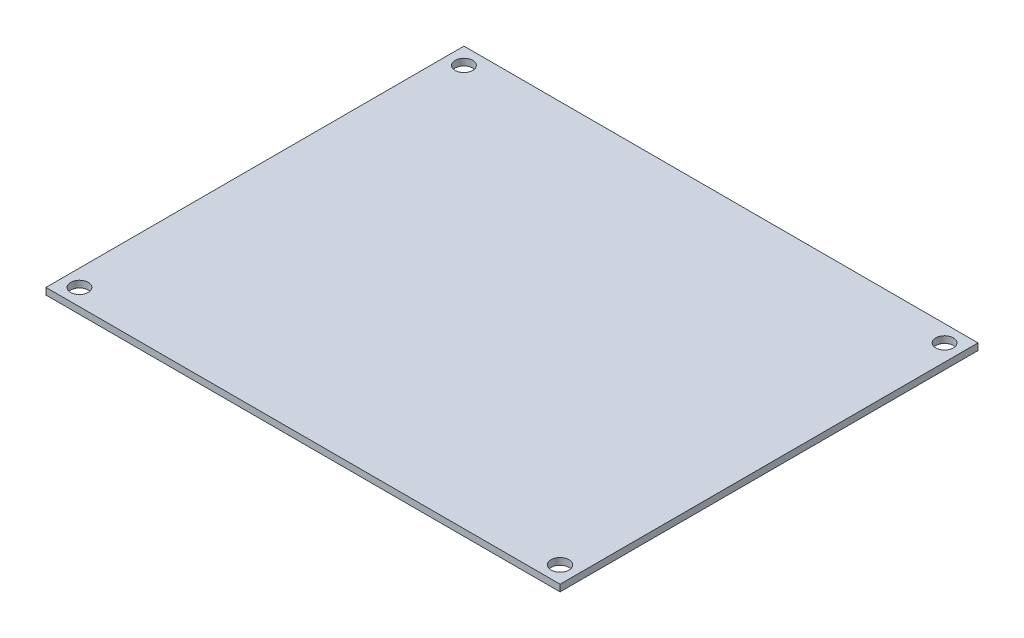
ISO-10303-21;
HEADER;
FILE_DESCRIPTION(('STEP AP214'),'2;1');
FILE_NAME('part.step','',(''),(''),'','','');
FILE_SCHEMA(('AUTOMOTIVE_DESIGN { 1 0 10303 214 1 1 1 1 }'));
ENDSEC;
DATA;
#1=APPLICATION_CONTEXT('core data for automotive mechanical design processes');
#2=APPLICATION_PROTOCOL_DEFINITION('international standard','automotive_design',2000,#1);
#3=PRODUCT_CONTEXT('',#1,'mechanical');
#4=PRODUCT('Part','Part','',(#3));
#5=PRODUCT_RELATED_PRODUCT_CATEGORY('part','',(#4));
#6=PRODUCT_DEFINITION_FORMATION('','',#4);
#7=PRODUCT_DEFINITION_CONTEXT('part definition',#1,'design');
#8=PRODUCT_DEFINITION('design','',#6,#7);
#9=PRODUCT_DEFINITION_SHAPE('','',#8);
#10=(LENGTH_UNIT() NAMED_UNIT(*) SI_UNIT(.MILLI.,.METRE.));
#11=(NAMED_UNIT(*) PLANE_ANGLE_UNIT() SI_UNIT($,.RADIAN.));
#12=(NAMED_UNIT(*) SI_UNIT($,.STERADIAN.) SOLID_ANGLE_UNIT());
#13=UNCERTAINTY_MEASURE_WITH_UNIT(LENGTH_MEASURE(1.E-05),#10,'distance_accuracy_value','');
#14=(GEOMETRIC_REPRESENTATION_CONTEXT(3) GLOBAL_UNCERTAINTY_ASSIGNED_CONTEXT((#13)) GLOBAL_UNIT_ASSIGNED_CONTEXT((#10,
#11,#12)) REPRESENTATION_CONTEXT('',''));
#15=CARTESIAN_POINT('',(0.,0.,0.));
#16=DIRECTION('',(0.,0.,1.));
#17=DIRECTION('',(1.,0.,0.));
#18=AXIS2_PLACEMENT_3D('',#15,#16,#17);
#19=CARTESIAN_POINT('',(0.,0.,0.));
#20=DIRECTION('',(0.,1.,0.));
#21=DIRECTION('',(0.,0.,1.));
#22=AXIS2_PLACEMENT_3D('',#19,#20,#21);
#23=PLANE('',#22);
#24=CARTESIAN_POINT('',(-57.5,0.,46.));
#25=DIRECTION('',(0.,1.,0.));
#26=DIRECTION('',(0.,0.,1.));
#27=AXIS2_PLACEMENT_3D('',#24,#25,#26);
#28=CIRCLE('',#27,2.1);
#29=CARTESIAN_POINT('',(-57.5,0.,48.1));
#30=VERTEX_POINT('',#29);
#31=EDGE_CURVE('E105',#30,#30,#28,.T.);
#32=ORIENTED_EDGE('',*,*,#31,.T.);
#33=EDGE_LOOP('',(#32));
#34=FACE_BOUND('',#33,.T.);
#35=CARTESIAN_POINT('',(57.5,0.,46.));
#36=DIRECTION('',(0.,1.,0.));
#37=DIRECTION('',(0.,0.,1.));
#38=AXIS2_PLACEMENT_3D('',#35,#36,#37);
#39=CIRCLE('',#38,2.15);
#40=CARTESIAN_POINT('',(57.5,0.,48.15));
#41=VERTEX_POINT('',#40);
#42=EDGE_CURVE('E110',#41,#41,#39,.T.);
#43=ORIENTED_EDGE('',*,*,#42,.T.);
#44=EDGE_LOOP('',(#43));
#45=FACE_BOUND('',#44,.T.);
#46=CARTESIAN_POINT('',(-57.5,0.,-46.));
#47=DIRECTION('',(0.,1.,0.));
#48=DIRECTION('',(0.,0.,1.));
#49=AXIS2_PLACEMENT_3D('',#46,#47,#48);
#50=CIRCLE('',#49,2.1);
#51=CARTESIAN_POINT('',(-57.5,0.,-43.9));
#52=VERTEX_POINT('',#51);
#53=EDGE_CURVE('E113',#52,#52,#50,.T.);
#54=ORIENTED_EDGE('',*,*,#53,.T.);
#55=EDGE_LOOP('',(#54));
#56=FACE_BOUND('',#55,.T.);
#57=CARTESIAN_POINT('',(57.5,0.,-46.));
#58=DIRECTION('',(0.,1.,0.));
#59=DIRECTION('',(0.,0.,1.));
#60=AXIS2_PLACEMENT_3D('',#57,#58,#59);
#61=CIRCLE('',#60,2.1);
#62=CARTESIAN_POINT('',(57.5,0.,-43.9));
#63=VERTEX_POINT('',#62);
#64=EDGE_CURVE('E19',#63,#63,#61,.T.);
#65=ORIENTED_EDGE('',*,*,#64,.T.);
#66=EDGE_LOOP('',(#65));
#67=FACE_BOUND('',#66,.T.);
#68=DIRECTION('',(0.,0.,1.));
#69=VECTOR('',#68,1.);
#70=CARTESIAN_POINT('',(-61.5,0.,-50.));
#71=LINE('',#70,#69);
#72=CARTESIAN_POINT('',(-61.5,0.,-50.));
#73=VERTEX_POINT('',#72);
#74=CARTESIAN_POINT('',(-61.5,0.,50.));
#75=VERTEX_POINT('',#74);
#76=EDGE_CURVE('E124',#73,#75,#71,.T.);
#77=ORIENTED_EDGE('',*,*,#76,.F.);
#78=DIRECTION('',(-1.,0.,0.));
#79=VECTOR('',#78,1.);
#80=CARTESIAN_POINT('',(61.5,0.,-50.));
#81=LINE('',#80,#79);
#82=CARTESIAN_POINT('',(61.5,0.,-50.));
#83=VERTEX_POINT('',#82);
#84=EDGE_CURVE('E59',#83,#73,#81,.T.);
#85=ORIENTED_EDGE('',*,*,#84,.F.);
#86=DIRECTION('',(0.,0.,-1.));
#87=VECTOR('',#86,1.);
#88=CARTESIAN_POINT('',(61.5,0.,50.));
#89=LINE('',#88,#87);
#90=CARTESIAN_POINT('',(61.5,0.,50.));
#91=VERTEX_POINT('',#90);
#92=EDGE_CURVE('E62',#91,#83,#89,.T.);
#93=ORIENTED_EDGE('',*,*,#92,.F.);
#94=DIRECTION('',(1.,0.,0.));
#95=VECTOR('',#94,1.);
#96=CARTESIAN_POINT('',(-61.5,0.,50.));
#97=LINE('',#96,#95);
#98=EDGE_CURVE('E64',#75,#91,#97,.T.);
#99=ORIENTED_EDGE('',*,*,#98,.F.);
#100=EDGE_LOOP('',(#77,#85,#93,#99));
#101=FACE_BOUND('',#100,.T.);
#102=ADVANCED_FACE('F16',(#34,#45,#56,#67,#101),#23,.F.);
#103=CARTESIAN_POINT('',(-61.5,0.,50.));
#104=DIRECTION('',(0.,0.,1.));
#105=DIRECTION('',(1.,0.,0.));
#106=AXIS2_PLACEMENT_3D('',#103,#104,#105);
#107=PLANE('',#106);
#108=DIRECTION('',(1.,0.,0.));
#109=VECTOR('',#108,1.);
#110=CARTESIAN_POINT('',(0.,1.6,50.));
#111=LINE('',#110,#109);
#112=CARTESIAN_POINT('',(-61.5,1.6,50.));
#113=VERTEX_POINT('',#112);
#114=CARTESIAN_POINT('',(61.5,1.6,50.));
#115=VERTEX_POINT('',#114);
#116=EDGE_CURVE('E109',#113,#115,#111,.T.);
#117=ORIENTED_EDGE('',*,*,#116,.F.);
#118=DIRECTION('',(0.,1.,0.));
#119=VECTOR('',#118,1.);
#120=CARTESIAN_POINT('',(-61.5,0.,50.));
#121=LINE('',#120,#119);
#122=EDGE_CURVE('E76',#75,#113,#121,.T.);
#123=ORIENTED_EDGE('',*,*,#122,.F.);
#124=ORIENTED_EDGE('',*,*,#98,.T.);
#125=DIRECTION('',(0.,1.,0.));
#126=VECTOR('',#125,1.);
#127=CARTESIAN_POINT('',(61.5,0.,50.));
#128=LINE('',#127,#126);
#129=EDGE_CURVE('E70',#115,#91,#128,.F.);
#130=ORIENTED_EDGE('',*,*,#129,.F.);
#131=EDGE_LOOP('',(#117,#123,#124,#130));
#132=FACE_BOUND('',#131,.T.);
#133=ADVANCED_FACE('F73',(#132),#107,.T.);
#134=CARTESIAN_POINT('',(61.5,0.,50.));
#135=DIRECTION('',(1.,0.,0.));
#136=DIRECTION('',(0.,0.,-1.));
#137=AXIS2_PLACEMENT_3D('',#134,#135,#136);
#138=PLANE('',#137);
#139=DIRECTION('',(0.,0.,1.));
#140=VECTOR('',#139,1.);
#141=CARTESIAN_POINT('',(61.5,1.6,0.));
#142=LINE('',#141,#140);
#143=CARTESIAN_POINT('',(61.5,1.6,-50.));
#144=VERTEX_POINT('',#143);
#145=EDGE_CURVE('E82',#115,#144,#142,.F.);
#146=ORIENTED_EDGE('',*,*,#145,.F.);
#147=ORIENTED_EDGE('',*,*,#129,.T.);
#148=ORIENTED_EDGE('',*,*,#92,.T.);
#149=DIRECTION('',(0.,1.,0.));
#150=VECTOR('',#149,1.);
#151=CARTESIAN_POINT('',(61.5,0.,-50.));
#152=LINE('',#151,#150);
#153=EDGE_CURVE('E90',#144,#83,#152,.F.);
#154=ORIENTED_EDGE('',*,*,#153,.F.);
#155=EDGE_LOOP('',(#146,#147,#148,#154));
#156=FACE_BOUND('',#155,.T.);
#157=ADVANCED_FACE('F80',(#156),#138,.T.);
#158=CARTESIAN_POINT('',(61.5,0.,-50.));
#159=DIRECTION('',(0.,0.,-1.));
#160=DIRECTION('',(-1.,0.,0.));
#161=AXIS2_PLACEMENT_3D('',#158,#159,#160);
#162=PLANE('',#161);
#163=DIRECTION('',(1.,0.,0.));
#164=VECTOR('',#163,1.);
#165=CARTESIAN_POINT('',(0.,1.6,-50.));
#166=LINE('',#165,#164);
#167=CARTESIAN_POINT('',(-61.5,1.6,-50.));
#168=VERTEX_POINT('',#167);
#169=EDGE_CURVE('E132',#144,#168,#166,.F.);
#170=ORIENTED_EDGE('',*,*,#169,.F.);
#171=ORIENTED_EDGE('',*,*,#153,.T.);
#172=ORIENTED_EDGE('',*,*,#84,.T.);
#173=DIRECTION('',(0.,1.,0.));
#174=VECTOR('',#173,1.);
#175=CARTESIAN_POINT('',(-61.5,0.,-50.));
#176=LINE('',#175,#174);
#177=EDGE_CURVE('E38',#168,#73,#176,.F.);
#178=ORIENTED_EDGE('',*,*,#177,.F.);
#179=EDGE_LOOP('',(#170,#171,#172,#178));
#180=FACE_BOUND('',#179,.T.);
#181=ADVANCED_FACE('F130',(#180),#162,.T.);
#182=CARTESIAN_POINT('',(-61.5,0.,-50.));
#183=DIRECTION('',(-1.,0.,0.));
#184=DIRECTION('',(0.,0.,1.));
#185=AXIS2_PLACEMENT_3D('',#182,#183,#184);
#186=PLANE('',#185);
#187=DIRECTION('',(0.,0.,1.));
#188=VECTOR('',#187,1.);
#189=CARTESIAN_POINT('',(-61.5,1.6,0.));
#190=LINE('',#189,#188);
#191=EDGE_CURVE('E104',#168,#113,#190,.T.);
#192=ORIENTED_EDGE('',*,*,#191,.F.);
#193=ORIENTED_EDGE('',*,*,#177,.T.);
#194=ORIENTED_EDGE('',*,*,#76,.T.);
#195=ORIENTED_EDGE('',*,*,#122,.T.);
#196=EDGE_LOOP('',(#192,#193,#194,#195));
#197=FACE_BOUND('',#196,.T.);
#198=ADVANCED_FACE('F140',(#197),#186,.T.);
#199=CARTESIAN_POINT('',(57.5,0.,-46.));
#200=DIRECTION('',(0.,1.,0.));
#201=DIRECTION('',(0.,0.,1.));
#202=AXIS2_PLACEMENT_3D('',#199,#200,#201);
#203=CYLINDRICAL_SURFACE('',#202,2.1);
#204=ORIENTED_EDGE('',*,*,#64,.F.);
#205=EDGE_LOOP('',(#204));
#206=FACE_BOUND('',#205,.T.);
#207=CARTESIAN_POINT('',(57.5,1.6,-46.));
#208=DIRECTION('',(0.,1.,0.));
#209=DIRECTION('',(0.,0.,1.));
#210=AXIS2_PLACEMENT_3D('',#207,#208,#209);
#211=CIRCLE('',#210,2.1);
#212=CARTESIAN_POINT('',(57.5,1.6,-43.9));
#213=VERTEX_POINT('',#212);
#214=EDGE_CURVE('E101',#213,#213,#211,.F.);
#215=ORIENTED_EDGE('',*,*,#214,.F.);
#216=EDGE_LOOP('',(#215));
#217=FACE_BOUND('',#216,.T.);
#218=ADVANCED_FACE('F142',(#206,#217),#203,.F.);
#219=CARTESIAN_POINT('',(-57.5,0.,-46.));
#220=DIRECTION('',(0.,1.,0.));
#221=DIRECTION('',(0.,0.,1.));
#222=AXIS2_PLACEMENT_3D('',#219,#220,#221);
#223=CYLINDRICAL_SURFACE('',#222,2.1);
#224=ORIENTED_EDGE('',*,*,#53,.F.);
#225=EDGE_LOOP('',(#224));
#226=FACE_BOUND('',#225,.T.);
#227=CARTESIAN_POINT('',(-57.5,1.6,-46.));
#228=DIRECTION('',(0.,1.,0.));
#229=DIRECTION('',(0.,0.,1.));
#230=AXIS2_PLACEMENT_3D('',#227,#228,#229);
#231=CIRCLE('',#230,2.1);
#232=CARTESIAN_POINT('',(-57.5,1.6,-43.9));
#233=VERTEX_POINT('',#232);
#234=EDGE_CURVE('E97',#233,#233,#231,.F.);
#235=ORIENTED_EDGE('',*,*,#234,.F.);
#236=EDGE_LOOP('',(#235));
#237=FACE_BOUND('',#236,.T.);
#238=ADVANCED_FACE('F149',(#226,#237),#223,.F.);
#239=CARTESIAN_POINT('',(57.5,0.,46.));
#240=DIRECTION('',(0.,1.,0.));
#241=DIRECTION('',(0.,0.,1.));
#242=AXIS2_PLACEMENT_3D('',#239,#240,#241);
#243=CYLINDRICAL_SURFACE('',#242,2.15);
#244=ORIENTED_EDGE('',*,*,#42,.F.);
#245=EDGE_LOOP('',(#244));
#246=FACE_BOUND('',#245,.T.);
#247=CARTESIAN_POINT('',(57.5,1.6,46.));
#248=DIRECTION('',(0.,1.,0.));
#249=DIRECTION('',(0.,0.,1.));
#250=AXIS2_PLACEMENT_3D('',#247,#248,#249);
#251=CIRCLE('',#250,2.15);
#252=CARTESIAN_POINT('',(57.5,1.6,48.15));
#253=VERTEX_POINT('',#252);
#254=EDGE_CURVE('E26',#253,#253,#251,.F.);
#255=ORIENTED_EDGE('',*,*,#254,.F.);
#256=EDGE_LOOP('',(#255));
#257=FACE_BOUND('',#256,.T.);
#258=ADVANCED_FACE('F161',(#246,#257),#243,.F.);
#259=CARTESIAN_POINT('',(-57.5,0.,46.));
#260=DIRECTION('',(0.,1.,0.));
#261=DIRECTION('',(0.,0.,1.));
#262=AXIS2_PLACEMENT_3D('',#259,#260,#261);
#263=CYLINDRICAL_SURFACE('',#262,2.1);
#264=ORIENTED_EDGE('',*,*,#31,.F.);
#265=EDGE_LOOP('',(#264));
#266=FACE_BOUND('',#265,.T.);
#267=CARTESIAN_POINT('',(-57.5,1.6,46.));
#268=DIRECTION('',(0.,1.,0.));
#269=DIRECTION('',(0.,0.,1.));
#270=AXIS2_PLACEMENT_3D('',#267,#268,#269);
#271=CIRCLE('',#270,2.1);
#272=CARTESIAN_POINT('',(-57.5,1.6,48.1));
#273=VERTEX_POINT('',#272);
#274=EDGE_CURVE('E11',#273,#273,#271,.F.);
#275=ORIENTED_EDGE('',*,*,#274,.F.);
#276=EDGE_LOOP('',(#275));
#277=FACE_BOUND('',#276,.T.);
#278=ADVANCED_FACE('F154',(#266,#277),#263,.F.);
#279=CARTESIAN_POINT('',(0.,1.6,0.));
#280=DIRECTION('',(0.,1.,0.));
#281=DIRECTION('',(0.,0.,1.));
#282=AXIS2_PLACEMENT_3D('',#279,#280,#281);
#283=PLANE('',#282);
#284=ORIENTED_EDGE('',*,*,#274,.T.);
#285=EDGE_LOOP('',(#284));
#286=FACE_BOUND('',#285,.T.);
#287=ORIENTED_EDGE('',*,*,#254,.T.);
#288=EDGE_LOOP('',(#287));
#289=FACE_BOUND('',#288,.T.);
#290=ORIENTED_EDGE('',*,*,#234,.T.);
#291=EDGE_LOOP('',(#290));
#292=FACE_BOUND('',#291,.T.);
#293=ORIENTED_EDGE('',*,*,#214,.T.);
#294=EDGE_LOOP('',(#293));
#295=FACE_BOUND('',#294,.T.);
#296=ORIENTED_EDGE('',*,*,#169,.T.);
#297=ORIENTED_EDGE('',*,*,#191,.T.);
#298=ORIENTED_EDGE('',*,*,#116,.T.);
#299=ORIENTED_EDGE('',*,*,#145,.T.);
#300=EDGE_LOOP('',(#296,#297,#298,#299));
#301=FACE_BOUND('',#300,.T.);
#302=ADVANCED_FACE('F137',(#286,#289,#292,#295,#301),#283,.T.);
#303=CLOSED_SHELL('',(#102,#133,#157,#181,#198,#218,#238,#258,#278,#302));
#304=MANIFOLD_SOLID_BREP('B1',#303);
#305=ADVANCED_BREP_SHAPE_REPRESENTATION('',(#18,#304),#14);
#306=SHAPE_DEFINITION_REPRESENTATION(#9,#305);
ENDSEC;
END-ISO-10303-21;
